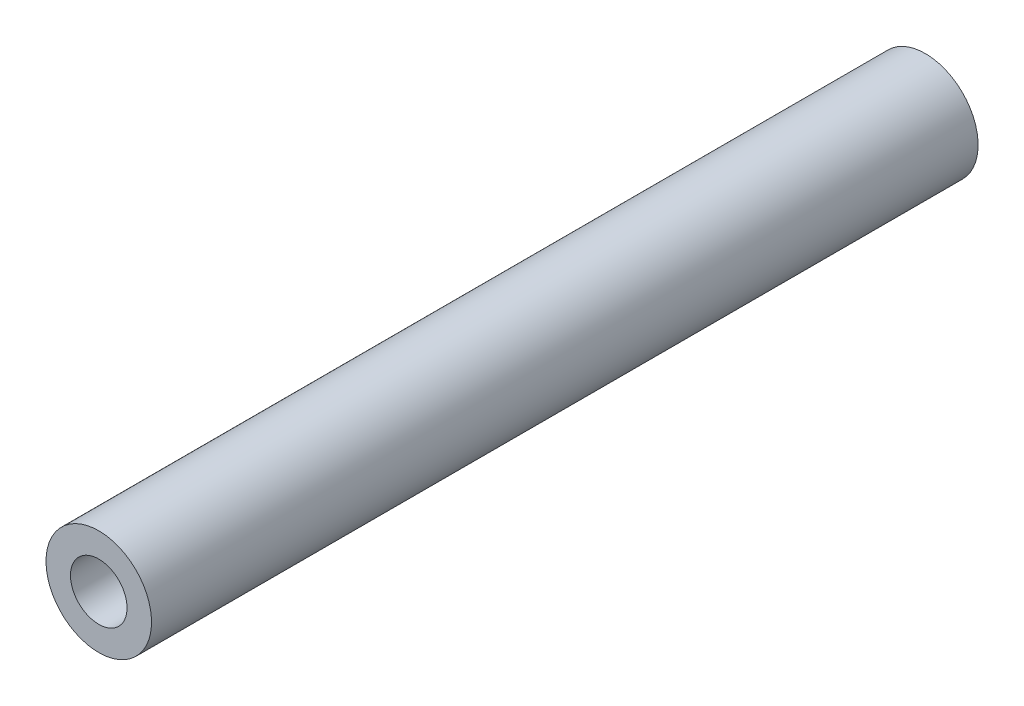
ISO-10303-21;
HEADER;
FILE_DESCRIPTION(('STEP AP214'),'2;1');
FILE_NAME('part.step','',(''),(''),'','','');
FILE_SCHEMA(('AUTOMOTIVE_DESIGN { 1 0 10303 214 1 1 1 1 }'));
ENDSEC;
DATA;
#1=APPLICATION_CONTEXT('core data for automotive mechanical design processes');
#2=APPLICATION_PROTOCOL_DEFINITION('international standard','automotive_design',2000,#1);
#3=PRODUCT_CONTEXT('',#1,'mechanical');
#4=PRODUCT('Part','Part','',(#3));
#5=PRODUCT_RELATED_PRODUCT_CATEGORY('part','',(#4));
#6=PRODUCT_DEFINITION_FORMATION('','',#4);
#7=PRODUCT_DEFINITION_CONTEXT('part definition',#1,'design');
#8=PRODUCT_DEFINITION('design','',#6,#7);
#9=PRODUCT_DEFINITION_SHAPE('','',#8);
#10=(LENGTH_UNIT() NAMED_UNIT(*) SI_UNIT(.MILLI.,.METRE.));
#11=(NAMED_UNIT(*) PLANE_ANGLE_UNIT() SI_UNIT($,.RADIAN.));
#12=(NAMED_UNIT(*) SI_UNIT($,.STERADIAN.) SOLID_ANGLE_UNIT());
#13=UNCERTAINTY_MEASURE_WITH_UNIT(LENGTH_MEASURE(1.E-05),#10,'distance_accuracy_value','');
#14=(GEOMETRIC_REPRESENTATION_CONTEXT(3) GLOBAL_UNCERTAINTY_ASSIGNED_CONTEXT((#13)) GLOBAL_UNIT_ASSIGNED_CONTEXT((#10,
#11,#12)) REPRESENTATION_CONTEXT('',''));
#15=CARTESIAN_POINT('',(0.,0.,0.));
#16=DIRECTION('',(0.,0.,1.));
#17=DIRECTION('',(1.,0.,0.));
#18=AXIS2_PLACEMENT_3D('',#15,#16,#17);
#19=CARTESIAN_POINT('',(0.,0.,37.30625));
#20=DIRECTION('',(0.,0.,-1.));
#21=DIRECTION('',(-1.,0.,0.));
#22=AXIS2_PLACEMENT_3D('',#19,#20,#21);
#23=CYLINDRICAL_SURFACE('',#22,2.5527);
#24=CARTESIAN_POINT('',(0.,0.,-37.30625));
#25=DIRECTION('',(0.,0.,-1.));
#26=DIRECTION('',(-1.,0.,0.));
#27=AXIS2_PLACEMENT_3D('',#24,#25,#26);
#28=CIRCLE('',#27,2.5527);
#29=CARTESIAN_POINT('',(-2.5527,0.,-37.30625));
#30=VERTEX_POINT('',#29);
#31=EDGE_CURVE('E27',#30,#30,#28,.T.);
#32=ORIENTED_EDGE('',*,*,#31,.T.);
#33=EDGE_LOOP('',(#32));
#34=FACE_BOUND('',#33,.T.);
#35=CARTESIAN_POINT('',(0.,0.,37.30625));
#36=DIRECTION('',(0.,0.,-1.));
#37=DIRECTION('',(-1.,0.,0.));
#38=AXIS2_PLACEMENT_3D('',#35,#36,#37);
#39=CIRCLE('',#38,2.5527);
#40=CARTESIAN_POINT('',(-2.5527,0.,37.30625));
#41=VERTEX_POINT('',#40);
#42=EDGE_CURVE('E18',#41,#41,#39,.T.);
#43=ORIENTED_EDGE('',*,*,#42,.F.);
#44=EDGE_LOOP('',(#43));
#45=FACE_BOUND('',#44,.T.);
#46=ADVANCED_FACE('F15',(#34,#45),#23,.F.);
#47=CARTESIAN_POINT('',(0.,0.,37.30625));
#48=DIRECTION('',(0.,0.,1.));
#49=DIRECTION('',(1.,0.,0.));
#50=AXIS2_PLACEMENT_3D('',#47,#48,#49);
#51=PLANE('',#50);
#52=ORIENTED_EDGE('',*,*,#42,.T.);
#53=EDGE_LOOP('',(#52));
#54=FACE_BOUND('',#53,.T.);
#55=CARTESIAN_POINT('',(0.,0.,37.30625));
#56=DIRECTION('',(0.,0.,-1.));
#57=DIRECTION('',(-1.,0.,0.));
#58=AXIS2_PLACEMENT_3D('',#55,#56,#57);
#59=CIRCLE('',#58,4.7625);
#60=CARTESIAN_POINT('',(-4.7625,0.,37.30625));
#61=VERTEX_POINT('',#60);
#62=EDGE_CURVE('E22',#61,#61,#59,.T.);
#63=ORIENTED_EDGE('',*,*,#62,.F.);
#64=EDGE_LOOP('',(#63));
#65=FACE_BOUND('',#64,.T.);
#66=ADVANCED_FACE('F35',(#54,#65),#51,.T.);
#67=CARTESIAN_POINT('',(0.,0.,-37.30625));
#68=DIRECTION('',(0.,0.,1.));
#69=DIRECTION('',(1.,0.,0.));
#70=AXIS2_PLACEMENT_3D('',#67,#68,#69);
#71=PLANE('',#70);
#72=ORIENTED_EDGE('',*,*,#31,.F.);
#73=EDGE_LOOP('',(#72));
#74=FACE_BOUND('',#73,.T.);
#75=CARTESIAN_POINT('',(0.,0.,-37.30625));
#76=DIRECTION('',(0.,0.,-1.));
#77=DIRECTION('',(-1.,0.,0.));
#78=AXIS2_PLACEMENT_3D('',#75,#76,#77);
#79=CIRCLE('',#78,4.7625);
#80=CARTESIAN_POINT('',(-4.7625,0.,-37.30625));
#81=VERTEX_POINT('',#80);
#82=EDGE_CURVE('E10',#81,#81,#79,.F.);
#83=ORIENTED_EDGE('',*,*,#82,.F.);
#84=EDGE_LOOP('',(#83));
#85=FACE_BOUND('',#84,.T.);
#86=ADVANCED_FACE('F43',(#74,#85),#71,.F.);
#87=CARTESIAN_POINT('',(0.,0.,37.30625));
#88=DIRECTION('',(0.,0.,-1.));
#89=DIRECTION('',(-1.,0.,0.));
#90=AXIS2_PLACEMENT_3D('',#87,#88,#89);
#91=CYLINDRICAL_SURFACE('',#90,4.7625);
#92=ORIENTED_EDGE('',*,*,#82,.T.);
#93=EDGE_LOOP('',(#92));
#94=FACE_BOUND('',#93,.T.);
#95=ORIENTED_EDGE('',*,*,#62,.T.);
#96=EDGE_LOOP('',(#95));
#97=FACE_BOUND('',#96,.T.);
#98=ADVANCED_FACE('F44',(#94,#97),#91,.T.);
#99=CLOSED_SHELL('',(#46,#66,#86,#98));
#100=MANIFOLD_SOLID_BREP('B1',#99);
#101=ADVANCED_BREP_SHAPE_REPRESENTATION('',(#18,#100),#14);
#102=SHAPE_DEFINITION_REPRESENTATION(#9,#101);
ENDSEC;
END-ISO-10303-21;
